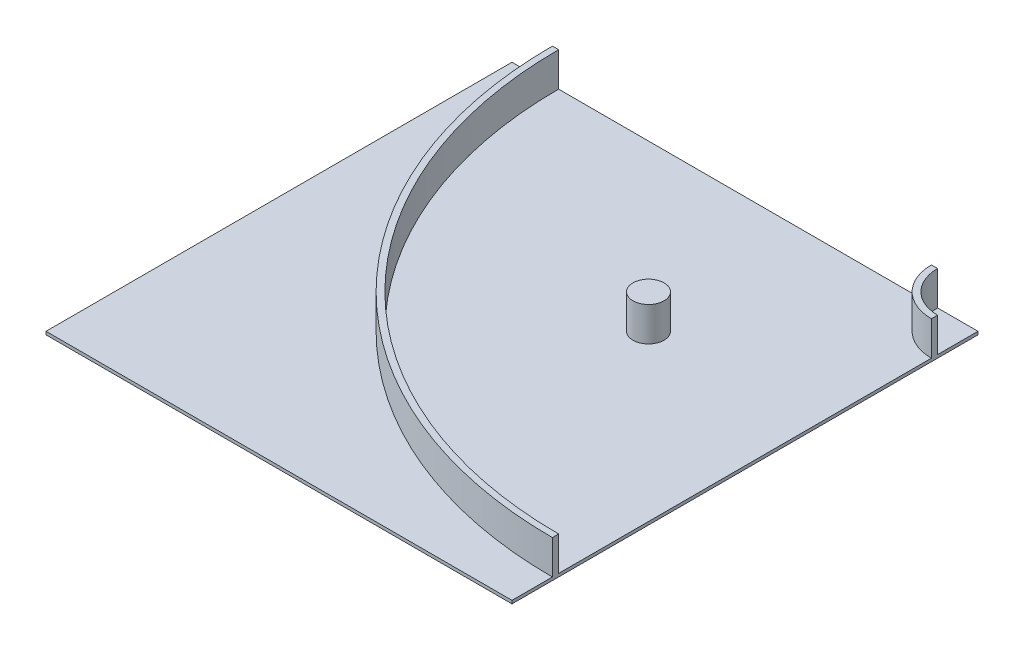
ISO-10303-21;
HEADER;
FILE_DESCRIPTION(('STEP AP214'),'2;1');
FILE_NAME('part.step','',(''),(''),'','','');
FILE_SCHEMA(('AUTOMOTIVE_DESIGN { 1 0 10303 214 1 1 1 1 }'));
ENDSEC;
DATA;
#1=APPLICATION_CONTEXT('core data for automotive mechanical design processes');
#2=APPLICATION_PROTOCOL_DEFINITION('international standard','automotive_design',2000,#1);
#3=PRODUCT_CONTEXT('',#1,'mechanical');
#4=PRODUCT('Part','Part','',(#3));
#5=PRODUCT_RELATED_PRODUCT_CATEGORY('part','',(#4));
#6=PRODUCT_DEFINITION_FORMATION('','',#4);
#7=PRODUCT_DEFINITION_CONTEXT('part definition',#1,'design');
#8=PRODUCT_DEFINITION('design','',#6,#7);
#9=PRODUCT_DEFINITION_SHAPE('','',#8);
#10=(LENGTH_UNIT() NAMED_UNIT(*) SI_UNIT(.MILLI.,.METRE.));
#11=(NAMED_UNIT(*) PLANE_ANGLE_UNIT() SI_UNIT($,.RADIAN.));
#12=(NAMED_UNIT(*) SI_UNIT($,.STERADIAN.) SOLID_ANGLE_UNIT());
#13=UNCERTAINTY_MEASURE_WITH_UNIT(LENGTH_MEASURE(1.E-05),#10,'distance_accuracy_value','');
#14=(GEOMETRIC_REPRESENTATION_CONTEXT(3) GLOBAL_UNCERTAINTY_ASSIGNED_CONTEXT((#13)) GLOBAL_UNIT_ASSIGNED_CONTEXT((#10,
#11,#12)) REPRESENTATION_CONTEXT('',''));
#15=CARTESIAN_POINT('',(0.,0.,0.));
#16=DIRECTION('',(0.,0.,1.));
#17=DIRECTION('',(1.,0.,0.));
#18=AXIS2_PLACEMENT_3D('',#15,#16,#17);
#19=CARTESIAN_POINT('',(0.,10.,0.));
#20=DIRECTION('',(0.,1.,0.));
#21=DIRECTION('',(0.,0.,1.));
#22=AXIS2_PLACEMENT_3D('',#19,#20,#21);
#23=PLANE('',#22);
#24=CARTESIAN_POINT('',(219.66991411009,10.,-219.66991411009));
#25=DIRECTION('',(0.,1.,0.));
#26=DIRECTION('',(0.,0.,1.));
#27=AXIS2_PLACEMENT_3D('',#24,#25,#26);
#28=CIRCLE('',#27,50.);
#29=CARTESIAN_POINT('',(219.66991411009,10.,-169.66991411009));
#30=VERTEX_POINT('',#29);
#31=EDGE_CURVE('E434',#30,#30,#28,.T.);
#32=ORIENTED_EDGE('',*,*,#31,.F.);
#33=EDGE_LOOP('',(#32));
#34=FACE_BOUND('',#33,.T.);
#35=DIRECTION('',(0.,0.,-1.));
#36=VECTOR('',#35,1.);
#37=CARTESIAN_POINT('',(750.,10.,-750.));
#38=LINE('',#37,#36);
#39=CARTESIAN_POINT('',(750.,10.,599.999999999999));
#40=VERTEX_POINT('',#39);
#41=CARTESIAN_POINT('',(750.,10.,-600.));
#42=VERTEX_POINT('',#41);
#43=EDGE_CURVE('E88',#40,#42,#38,.T.);
#44=ORIENTED_EDGE('',*,*,#43,.T.);
#45=CARTESIAN_POINT('',(750.,10.,-750.));
#46=DIRECTION('',(0.,1.,0.));
#47=DIRECTION('',(0.,0.,1.));
#48=AXIS2_PLACEMENT_3D('',#45,#46,#47);
#49=CIRCLE('',#48,150.);
#50=CARTESIAN_POINT('',(600.,10.,-750.));
#51=VERTEX_POINT('',#50);
#52=EDGE_CURVE('E178',#51,#42,#49,.T.);
#53=ORIENTED_EDGE('',*,*,#52,.F.);
#54=DIRECTION('',(-1.,0.,0.));
#55=VECTOR('',#54,1.);
#56=CARTESIAN_POINT('',(-750.,10.,-750.));
#57=LINE('',#56,#55);
#58=CARTESIAN_POINT('',(-600.,10.,-750.));
#59=VERTEX_POINT('',#58);
#60=EDGE_CURVE('E236',#51,#59,#57,.T.);
#61=ORIENTED_EDGE('',*,*,#60,.T.);
#62=CARTESIAN_POINT('',(750.,10.,-750.));
#63=DIRECTION('',(0.,1.,0.));
#64=DIRECTION('',(0.,0.,1.));
#65=AXIS2_PLACEMENT_3D('',#62,#63,#64);
#66=CIRCLE('',#65,1350.);
#67=EDGE_CURVE('E198',#59,#40,#66,.T.);
#68=ORIENTED_EDGE('',*,*,#67,.T.);
#69=EDGE_LOOP('',(#44,#53,#61,#68));
#70=FACE_BOUND('',#69,.T.);
#71=ADVANCED_FACE('F62',(#34,#70),#23,.T.);
#72=CARTESIAN_POINT('',(750.,10.,-750.));
#73=DIRECTION('',(0.,1.,0.));
#74=DIRECTION('',(0.,0.,1.));
#75=AXIS2_PLACEMENT_3D('',#72,#73,#74);
#76=CIRCLE('',#75,130.);
#77=CARTESIAN_POINT('',(620.,10.,-750.));
#78=VERTEX_POINT('',#77);
#79=CARTESIAN_POINT('',(750.,10.,-620.));
#80=VERTEX_POINT('',#79);
#81=EDGE_CURVE('E80',#78,#80,#76,.T.);
#82=ORIENTED_EDGE('',*,*,#81,.T.);
#83=CARTESIAN_POINT('',(750.,10.,-750.));
#84=VERTEX_POINT('',#83);
#85=EDGE_CURVE('E66',#80,#84,#38,.T.);
#86=ORIENTED_EDGE('',*,*,#85,.T.);
#87=EDGE_CURVE('E237',#84,#78,#57,.T.);
#88=ORIENTED_EDGE('',*,*,#87,.T.);
#89=EDGE_LOOP('',(#82,#86,#88));
#90=FACE_BOUND('',#89,.T.);
#91=ADVANCED_FACE('F292',(#90),#23,.T.);
#92=CARTESIAN_POINT('',(750.,10.,-750.));
#93=DIRECTION('',(-1.,0.,0.));
#94=DIRECTION('',(0.,0.,1.));
#95=AXIS2_PLACEMENT_3D('',#92,#93,#94);
#96=PLANE('',#95);
#97=DIRECTION('',(0.,0.,-1.));
#98=VECTOR('',#97,1.);
#99=CARTESIAN_POINT('',(750.,0.,-750.));
#100=LINE('',#99,#98);
#101=CARTESIAN_POINT('',(750.,0.,750.));
#102=VERTEX_POINT('',#101);
#103=CARTESIAN_POINT('',(750.,0.,-750.));
#104=VERTEX_POINT('',#103);
#105=EDGE_CURVE('E225',#102,#104,#100,.T.);
#106=ORIENTED_EDGE('',*,*,#105,.T.);
#107=DIRECTION('',(0.,-1.,0.));
#108=VECTOR('',#107,1.);
#109=CARTESIAN_POINT('',(750.,10.,-750.));
#110=LINE('',#109,#108);
#111=EDGE_CURVE('E12',#84,#104,#110,.T.);
#112=ORIENTED_EDGE('',*,*,#111,.F.);
#113=ORIENTED_EDGE('',*,*,#85,.F.);
#114=DIRECTION('',(0.,-1.,0.));
#115=VECTOR('',#114,1.);
#116=CARTESIAN_POINT('',(750.,120.,-620.));
#117=LINE('',#116,#115);
#118=CARTESIAN_POINT('',(750.,120.,-620.));
#119=VERTEX_POINT('',#118);
#120=EDGE_CURVE('E187',#119,#80,#117,.T.);
#121=ORIENTED_EDGE('',*,*,#120,.F.);
#122=DIRECTION('',(0.,0.,-1.));
#123=VECTOR('',#122,1.);
#124=CARTESIAN_POINT('',(750.,120.,-1.11022302462516E-13));
#125=LINE('',#124,#123);
#126=CARTESIAN_POINT('',(750.,120.,-600.));
#127=VERTEX_POINT('',#126);
#128=EDGE_CURVE('E176',#127,#119,#125,.T.);
#129=ORIENTED_EDGE('',*,*,#128,.F.);
#130=DIRECTION('',(0.,-1.,0.));
#131=VECTOR('',#130,1.);
#132=CARTESIAN_POINT('',(750.,120.,-600.));
#133=LINE('',#132,#131);
#134=EDGE_CURVE('E190',#127,#42,#133,.T.);
#135=ORIENTED_EDGE('',*,*,#134,.T.);
#136=ORIENTED_EDGE('',*,*,#43,.F.);
#137=DIRECTION('',(0.,-1.,0.));
#138=VECTOR('',#137,1.);
#139=CARTESIAN_POINT('',(750.,120.,599.999999999999));
#140=LINE('',#139,#138);
#141=CARTESIAN_POINT('',(750.,120.,599.999999999999));
#142=VERTEX_POINT('',#141);
#143=EDGE_CURVE('E220',#142,#40,#140,.T.);
#144=ORIENTED_EDGE('',*,*,#143,.F.);
#145=DIRECTION('',(0.,0.,-1.));
#146=VECTOR('',#145,1.);
#147=CARTESIAN_POINT('',(750.,120.,-1.11022302462516E-13));
#148=LINE('',#147,#146);
#149=CARTESIAN_POINT('',(750.,120.,620.));
#150=VERTEX_POINT('',#149);
#151=EDGE_CURVE('E200',#150,#142,#148,.T.);
#152=ORIENTED_EDGE('',*,*,#151,.F.);
#153=DIRECTION('',(0.,-1.,0.));
#154=VECTOR('',#153,1.);
#155=CARTESIAN_POINT('',(750.,120.,620.));
#156=LINE('',#155,#154);
#157=CARTESIAN_POINT('',(750.,10.,620.));
#158=VERTEX_POINT('',#157);
#159=EDGE_CURVE('E216',#150,#158,#156,.T.);
#160=ORIENTED_EDGE('',*,*,#159,.T.);
#161=CARTESIAN_POINT('',(750.,10.,750.));
#162=VERTEX_POINT('',#161);
#163=EDGE_CURVE('E247',#162,#158,#38,.T.);
#164=ORIENTED_EDGE('',*,*,#163,.F.);
#165=DIRECTION('',(0.,-1.,0.));
#166=VECTOR('',#165,1.);
#167=CARTESIAN_POINT('',(750.,10.,750.));
#168=LINE('',#167,#166);
#169=EDGE_CURVE('E254',#162,#102,#168,.T.);
#170=ORIENTED_EDGE('',*,*,#169,.T.);
#171=EDGE_LOOP('',(#106,#112,#113,#121,#129,#135,#136,#144,#152,#160,#164,#170));
#172=FACE_BOUND('',#171,.T.);
#173=ADVANCED_FACE('F64',(#172),#96,.F.);
#174=CARTESIAN_POINT('',(-750.,10.,-750.));
#175=DIRECTION('',(0.,0.,1.));
#176=DIRECTION('',(1.,0.,0.));
#177=AXIS2_PLACEMENT_3D('',#174,#175,#176);
#178=PLANE('',#177);
#179=DIRECTION('',(-1.,0.,0.));
#180=VECTOR('',#179,1.);
#181=CARTESIAN_POINT('',(-750.,0.,-750.));
#182=LINE('',#181,#180);
#183=CARTESIAN_POINT('',(-750.,0.,-750.));
#184=VERTEX_POINT('',#183);
#185=EDGE_CURVE('E262',#104,#184,#182,.T.);
#186=ORIENTED_EDGE('',*,*,#185,.T.);
#187=DIRECTION('',(0.,-1.,0.));
#188=VECTOR('',#187,1.);
#189=CARTESIAN_POINT('',(-750.,10.,-750.));
#190=LINE('',#189,#188);
#191=CARTESIAN_POINT('',(-750.,10.,-750.));
#192=VERTEX_POINT('',#191);
#193=EDGE_CURVE('E72',#192,#184,#190,.T.);
#194=ORIENTED_EDGE('',*,*,#193,.F.);
#195=CARTESIAN_POINT('',(-620.,10.,-750.));
#196=VERTEX_POINT('',#195);
#197=EDGE_CURVE('E213',#196,#192,#57,.T.);
#198=ORIENTED_EDGE('',*,*,#197,.F.);
#199=DIRECTION('',(0.,-1.,0.));
#200=VECTOR('',#199,1.);
#201=CARTESIAN_POINT('',(-620.,120.,-750.));
#202=LINE('',#201,#200);
#203=CARTESIAN_POINT('',(-620.,120.,-750.));
#204=VERTEX_POINT('',#203);
#205=EDGE_CURVE('E219',#204,#196,#202,.T.);
#206=ORIENTED_EDGE('',*,*,#205,.F.);
#207=DIRECTION('',(-1.,0.,0.));
#208=VECTOR('',#207,1.);
#209=CARTESIAN_POINT('',(0.,120.,-750.));
#210=LINE('',#209,#208);
#211=CARTESIAN_POINT('',(-600.,120.,-750.));
#212=VERTEX_POINT('',#211);
#213=EDGE_CURVE('E194',#212,#204,#210,.T.);
#214=ORIENTED_EDGE('',*,*,#213,.F.);
#215=DIRECTION('',(0.,-1.,0.));
#216=VECTOR('',#215,1.);
#217=CARTESIAN_POINT('',(-600.,120.,-750.));
#218=LINE('',#217,#216);
#219=EDGE_CURVE('E205',#212,#59,#218,.T.);
#220=ORIENTED_EDGE('',*,*,#219,.T.);
#221=ORIENTED_EDGE('',*,*,#60,.F.);
#222=DIRECTION('',(0.,-1.,0.));
#223=VECTOR('',#222,1.);
#224=CARTESIAN_POINT('',(600.,120.,-750.));
#225=LINE('',#224,#223);
#226=CARTESIAN_POINT('',(600.,120.,-750.));
#227=VERTEX_POINT('',#226);
#228=EDGE_CURVE('E164',#227,#51,#225,.T.);
#229=ORIENTED_EDGE('',*,*,#228,.F.);
#230=DIRECTION('',(-1.,0.,0.));
#231=VECTOR('',#230,1.);
#232=CARTESIAN_POINT('',(0.,120.,-750.));
#233=LINE('',#232,#231);
#234=CARTESIAN_POINT('',(620.,120.,-750.));
#235=VERTEX_POINT('',#234);
#236=EDGE_CURVE('E167',#235,#227,#233,.T.);
#237=ORIENTED_EDGE('',*,*,#236,.F.);
#238=DIRECTION('',(0.,-1.,0.));
#239=VECTOR('',#238,1.);
#240=CARTESIAN_POINT('',(620.,120.,-750.));
#241=LINE('',#240,#239);
#242=EDGE_CURVE('E155',#235,#78,#241,.T.);
#243=ORIENTED_EDGE('',*,*,#242,.T.);
#244=ORIENTED_EDGE('',*,*,#87,.F.);
#245=ORIENTED_EDGE('',*,*,#111,.T.);
#246=EDGE_LOOP('',(#186,#194,#198,#206,#214,#220,#221,#229,#237,#243,#244,#245));
#247=FACE_BOUND('',#246,.T.);
#248=ADVANCED_FACE('F168',(#247),#178,.F.);
#249=CARTESIAN_POINT('',(-750.,10.,-750.));
#250=DIRECTION('',(1.,0.,0.));
#251=DIRECTION('',(0.,0.,-1.));
#252=AXIS2_PLACEMENT_3D('',#249,#250,#251);
#253=PLANE('',#252);
#254=DIRECTION('',(0.,0.,1.));
#255=VECTOR('',#254,1.);
#256=CARTESIAN_POINT('',(-750.,0.,-750.));
#257=LINE('',#256,#255);
#258=CARTESIAN_POINT('',(-750.,0.,750.));
#259=VERTEX_POINT('',#258);
#260=EDGE_CURVE('E260',#184,#259,#257,.T.);
#261=ORIENTED_EDGE('',*,*,#260,.T.);
#262=DIRECTION('',(0.,-1.,0.));
#263=VECTOR('',#262,1.);
#264=CARTESIAN_POINT('',(-750.,10.,750.));
#265=LINE('',#264,#263);
#266=CARTESIAN_POINT('',(-750.,10.,750.));
#267=VERTEX_POINT('',#266);
#268=EDGE_CURVE('E251',#267,#259,#265,.T.);
#269=ORIENTED_EDGE('',*,*,#268,.F.);
#270=DIRECTION('',(0.,0.,1.));
#271=VECTOR('',#270,1.);
#272=CARTESIAN_POINT('',(-750.,10.,-750.));
#273=LINE('',#272,#271);
#274=EDGE_CURVE('E241',#192,#267,#273,.T.);
#275=ORIENTED_EDGE('',*,*,#274,.F.);
#276=ORIENTED_EDGE('',*,*,#193,.T.);
#277=EDGE_LOOP('',(#261,#269,#275,#276));
#278=FACE_BOUND('',#277,.T.);
#279=ADVANCED_FACE('F274',(#278),#253,.F.);
#280=CARTESIAN_POINT('',(-750.,10.,750.));
#281=DIRECTION('',(0.,0.,-1.));
#282=DIRECTION('',(-1.,0.,0.));
#283=AXIS2_PLACEMENT_3D('',#280,#281,#282);
#284=PLANE('',#283);
#285=DIRECTION('',(1.,0.,0.));
#286=VECTOR('',#285,1.);
#287=CARTESIAN_POINT('',(-750.,0.,750.));
#288=LINE('',#287,#286);
#289=EDGE_CURVE('E258',#259,#102,#288,.T.);
#290=ORIENTED_EDGE('',*,*,#289,.T.);
#291=ORIENTED_EDGE('',*,*,#169,.F.);
#292=DIRECTION('',(1.,0.,0.));
#293=VECTOR('',#292,1.);
#294=CARTESIAN_POINT('',(-750.,10.,750.));
#295=LINE('',#294,#293);
#296=EDGE_CURVE('E257',#267,#162,#295,.T.);
#297=ORIENTED_EDGE('',*,*,#296,.F.);
#298=ORIENTED_EDGE('',*,*,#268,.T.);
#299=EDGE_LOOP('',(#290,#291,#297,#298));
#300=FACE_BOUND('',#299,.T.);
#301=ADVANCED_FACE('F278',(#300),#284,.F.);
#302=CARTESIAN_POINT('',(750.,10.,-750.));
#303=DIRECTION('',(0.,1.,0.));
#304=DIRECTION('',(0.,0.,1.));
#305=AXIS2_PLACEMENT_3D('',#302,#303,#304);
#306=CIRCLE('',#305,1370.);
#307=EDGE_CURVE('E163',#196,#158,#306,.T.);
#308=ORIENTED_EDGE('',*,*,#307,.F.);
#309=ORIENTED_EDGE('',*,*,#197,.T.);
#310=ORIENTED_EDGE('',*,*,#274,.T.);
#311=ORIENTED_EDGE('',*,*,#296,.T.);
#312=ORIENTED_EDGE('',*,*,#163,.T.);
#313=EDGE_LOOP('',(#308,#309,#310,#311,#312));
#314=FACE_BOUND('',#313,.T.);
#315=ADVANCED_FACE('F270',(#314),#23,.T.);
#316=CARTESIAN_POINT('',(0.,0.,0.));
#317=DIRECTION('',(0.,1.,0.));
#318=DIRECTION('',(0.,0.,1.));
#319=AXIS2_PLACEMENT_3D('',#316,#317,#318);
#320=PLANE('',#319);
#321=ORIENTED_EDGE('',*,*,#105,.F.);
#322=ORIENTED_EDGE('',*,*,#289,.F.);
#323=ORIENTED_EDGE('',*,*,#260,.F.);
#324=ORIENTED_EDGE('',*,*,#185,.F.);
#325=EDGE_LOOP('',(#321,#322,#323,#324));
#326=FACE_BOUND('',#325,.T.);
#327=ADVANCED_FACE('F290',(#326),#320,.F.);
#328=CARTESIAN_POINT('',(750.,120.,-750.));
#329=DIRECTION('',(0.,-1.,0.));
#330=DIRECTION('',(0.,0.,-1.));
#331=AXIS2_PLACEMENT_3D('',#328,#329,#330);
#332=CYLINDRICAL_SURFACE('',#331,1370.);
#333=ORIENTED_EDGE('',*,*,#307,.T.);
#334=ORIENTED_EDGE('',*,*,#159,.F.);
#335=CARTESIAN_POINT('',(750.,120.,-750.));
#336=DIRECTION('',(0.,1.,0.));
#337=DIRECTION('',(0.,0.,1.));
#338=AXIS2_PLACEMENT_3D('',#335,#336,#337);
#339=CIRCLE('',#338,1370.);
#340=EDGE_CURVE('E197',#204,#150,#339,.T.);
#341=ORIENTED_EDGE('',*,*,#340,.F.);
#342=ORIENTED_EDGE('',*,*,#205,.T.);
#343=EDGE_LOOP('',(#333,#334,#341,#342));
#344=FACE_BOUND('',#343,.T.);
#345=ADVANCED_FACE('F285',(#344),#332,.T.);
#346=CARTESIAN_POINT('',(750.,120.,-750.));
#347=DIRECTION('',(0.,-1.,0.));
#348=DIRECTION('',(0.,0.,-1.));
#349=AXIS2_PLACEMENT_3D('',#346,#347,#348);
#350=CYLINDRICAL_SURFACE('',#349,1350.);
#351=ORIENTED_EDGE('',*,*,#67,.F.);
#352=ORIENTED_EDGE('',*,*,#219,.F.);
#353=CARTESIAN_POINT('',(750.,120.,-750.));
#354=DIRECTION('',(0.,1.,0.));
#355=DIRECTION('',(0.,0.,1.));
#356=AXIS2_PLACEMENT_3D('',#353,#354,#355);
#357=CIRCLE('',#356,1350.);
#358=EDGE_CURVE('E202',#212,#142,#357,.T.);
#359=ORIENTED_EDGE('',*,*,#358,.T.);
#360=ORIENTED_EDGE('',*,*,#143,.T.);
#361=EDGE_LOOP('',(#351,#352,#359,#360));
#362=FACE_BOUND('',#361,.T.);
#363=ADVANCED_FACE('F363',(#362),#350,.F.);
#364=CARTESIAN_POINT('',(0.,120.,0.));
#365=DIRECTION('',(0.,1.,0.));
#366=DIRECTION('',(0.,0.,1.));
#367=AXIS2_PLACEMENT_3D('',#364,#365,#366);
#368=PLANE('',#367);
#369=ORIENTED_EDGE('',*,*,#213,.T.);
#370=ORIENTED_EDGE('',*,*,#340,.T.);
#371=ORIENTED_EDGE('',*,*,#151,.T.);
#372=ORIENTED_EDGE('',*,*,#358,.F.);
#373=EDGE_LOOP('',(#369,#370,#371,#372));
#374=FACE_BOUND('',#373,.T.);
#375=ADVANCED_FACE('F370',(#374),#368,.T.);
#376=CARTESIAN_POINT('',(750.,120.,-750.));
#377=DIRECTION('',(0.,-1.,0.));
#378=DIRECTION('',(0.,0.,-1.));
#379=AXIS2_PLACEMENT_3D('',#376,#377,#378);
#380=CYLINDRICAL_SURFACE('',#379,130.);
#381=ORIENTED_EDGE('',*,*,#81,.F.);
#382=ORIENTED_EDGE('',*,*,#242,.F.);
#383=CARTESIAN_POINT('',(750.,120.,-750.));
#384=DIRECTION('',(0.,1.,0.));
#385=DIRECTION('',(0.,0.,1.));
#386=AXIS2_PLACEMENT_3D('',#383,#384,#385);
#387=CIRCLE('',#386,130.);
#388=EDGE_CURVE('E160',#235,#119,#387,.T.);
#389=ORIENTED_EDGE('',*,*,#388,.T.);
#390=ORIENTED_EDGE('',*,*,#120,.T.);
#391=EDGE_LOOP('',(#381,#382,#389,#390));
#392=FACE_BOUND('',#391,.T.);
#393=ADVANCED_FACE('F157',(#392),#380,.F.);
#394=CARTESIAN_POINT('',(750.,120.,-750.));
#395=DIRECTION('',(0.,-1.,0.));
#396=DIRECTION('',(0.,0.,-1.));
#397=AXIS2_PLACEMENT_3D('',#394,#395,#396);
#398=CYLINDRICAL_SURFACE('',#397,150.);
#399=ORIENTED_EDGE('',*,*,#52,.T.);
#400=ORIENTED_EDGE('',*,*,#134,.F.);
#401=CARTESIAN_POINT('',(750.,120.,-750.));
#402=DIRECTION('',(0.,1.,0.));
#403=DIRECTION('',(0.,0.,1.));
#404=AXIS2_PLACEMENT_3D('',#401,#402,#403);
#405=CIRCLE('',#404,150.);
#406=EDGE_CURVE('E172',#227,#127,#405,.T.);
#407=ORIENTED_EDGE('',*,*,#406,.F.);
#408=ORIENTED_EDGE('',*,*,#228,.T.);
#409=EDGE_LOOP('',(#399,#400,#407,#408));
#410=FACE_BOUND('',#409,.T.);
#411=ADVANCED_FACE('F387',(#410),#398,.T.);
#412=CARTESIAN_POINT('',(0.,120.,0.));
#413=DIRECTION('',(0.,1.,0.));
#414=DIRECTION('',(0.,0.,1.));
#415=AXIS2_PLACEMENT_3D('',#412,#413,#414);
#416=PLANE('',#415);
#417=ORIENTED_EDGE('',*,*,#388,.F.);
#418=ORIENTED_EDGE('',*,*,#236,.T.);
#419=ORIENTED_EDGE('',*,*,#406,.T.);
#420=ORIENTED_EDGE('',*,*,#128,.T.);
#421=EDGE_LOOP('',(#417,#418,#419,#420));
#422=FACE_BOUND('',#421,.T.);
#423=ADVANCED_FACE('F174',(#422),#416,.T.);
#424=CARTESIAN_POINT('',(219.66991411009,261.42135623731,-219.66991411009));
#425=DIRECTION('',(0.,-1.,0.));
#426=DIRECTION('',(0.,0.,-1.));
#427=AXIS2_PLACEMENT_3D('',#424,#425,#426);
#428=CYLINDRICAL_SURFACE('',#427,50.);
#429=ORIENTED_EDGE('',*,*,#31,.T.);
#430=EDGE_LOOP('',(#429));
#431=FACE_BOUND('',#430,.T.);
#432=CARTESIAN_POINT('',(219.66991411009,120.,-219.66991411009));
#433=DIRECTION('',(0.,1.,0.));
#434=DIRECTION('',(0.,0.,1.));
#435=AXIS2_PLACEMENT_3D('',#432,#433,#434);
#436=CIRCLE('',#435,50.);
#437=CARTESIAN_POINT('',(219.66991411009,120.,-169.66991411009));
#438=VERTEX_POINT('',#437);
#439=EDGE_CURVE('E182',#438,#438,#436,.T.);
#440=ORIENTED_EDGE('',*,*,#439,.F.);
#441=EDGE_LOOP('',(#440));
#442=FACE_BOUND('',#441,.T.);
#443=ADVANCED_FACE('F403',(#431,#442),#428,.T.);
#444=CARTESIAN_POINT('',(0.,120.,0.));
#445=DIRECTION('',(0.,1.,0.));
#446=DIRECTION('',(0.,0.,1.));
#447=AXIS2_PLACEMENT_3D('',#444,#445,#446);
#448=PLANE('',#447);
#449=ORIENTED_EDGE('',*,*,#439,.T.);
#450=EDGE_LOOP('',(#449));
#451=FACE_BOUND('',#450,.T.);
#452=ADVANCED_FACE('F412',(#451),#448,.T.);
#453=CLOSED_SHELL('',(#71,#91,#173,#248,#279,#301,#315,#327,#345,#363,#375,#393,#411,#423,#443,#452));
#454=MANIFOLD_SOLID_BREP('B2',#453);
#455=ADVANCED_BREP_SHAPE_REPRESENTATION('',(#18,#454),#14);
#456=SHAPE_DEFINITION_REPRESENTATION(#9,#455);
ENDSEC;
END-ISO-10303-21;
